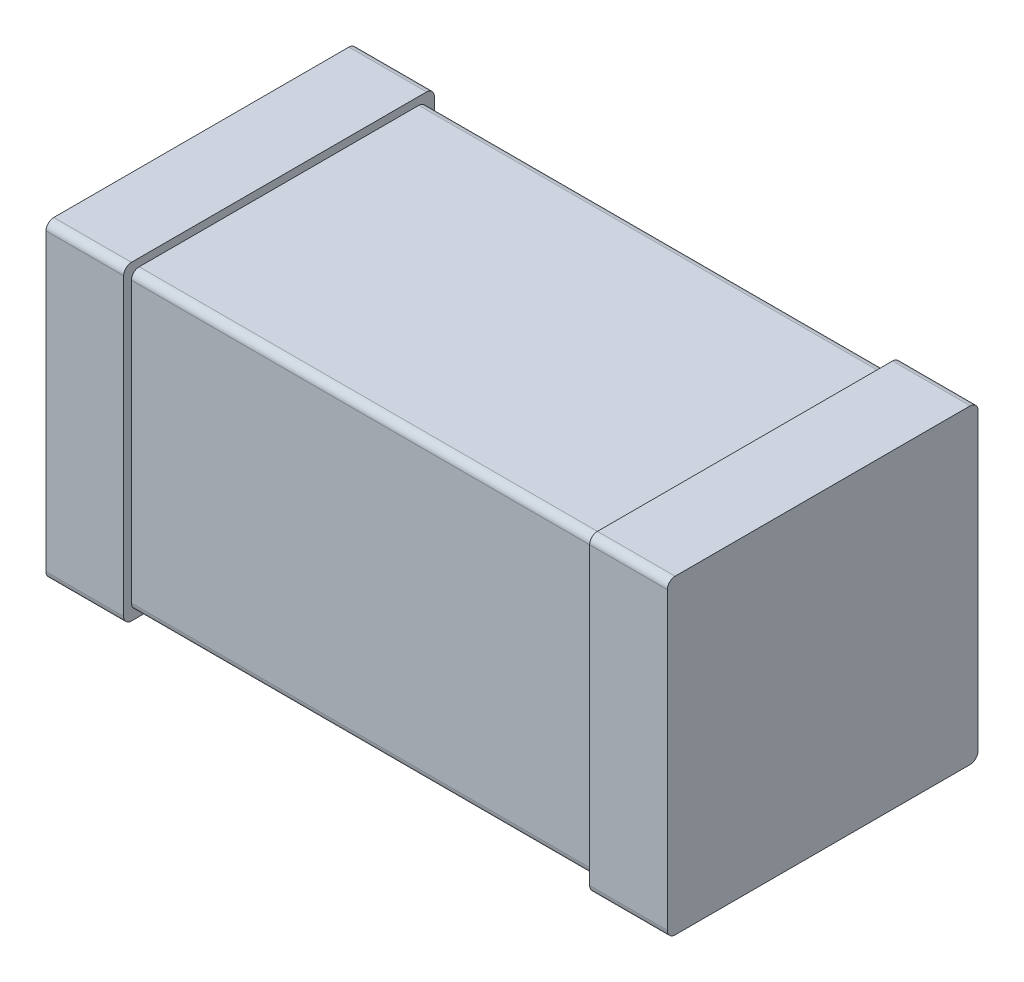
ISO-10303-21;
HEADER;
FILE_DESCRIPTION(('STEP AP214'),'2;1');
FILE_NAME('part.step','',(''),(''),'','','');
FILE_SCHEMA(('AUTOMOTIVE_DESIGN { 1 0 10303 214 1 1 1 1 }'));
ENDSEC;
DATA;
#1=APPLICATION_CONTEXT('core data for automotive mechanical design processes');
#2=APPLICATION_PROTOCOL_DEFINITION('international standard','automotive_design',2000,#1);
#3=PRODUCT_CONTEXT('',#1,'mechanical');
#4=PRODUCT('Part','Part','',(#3));
#5=PRODUCT_RELATED_PRODUCT_CATEGORY('part','',(#4));
#6=PRODUCT_DEFINITION_FORMATION('','',#4);
#7=PRODUCT_DEFINITION_CONTEXT('part definition',#1,'design');
#8=PRODUCT_DEFINITION('design','',#6,#7);
#9=PRODUCT_DEFINITION_SHAPE('','',#8);
#10=(LENGTH_UNIT() NAMED_UNIT(*) SI_UNIT(.MILLI.,.METRE.));
#11=(NAMED_UNIT(*) PLANE_ANGLE_UNIT() SI_UNIT($,.RADIAN.));
#12=(NAMED_UNIT(*) SI_UNIT($,.STERADIAN.) SOLID_ANGLE_UNIT());
#13=UNCERTAINTY_MEASURE_WITH_UNIT(LENGTH_MEASURE(1.E-05),#10,'distance_accuracy_value','');
#14=(GEOMETRIC_REPRESENTATION_CONTEXT(3) GLOBAL_UNCERTAINTY_ASSIGNED_CONTEXT((#13)) GLOBAL_UNIT_ASSIGNED_CONTEXT((#10,
#11,#12)) REPRESENTATION_CONTEXT('',''));
#15=CARTESIAN_POINT('',(0.,0.,0.));
#16=DIRECTION('',(0.,0.,1.));
#17=DIRECTION('',(1.,0.,0.));
#18=AXIS2_PLACEMENT_3D('',#15,#16,#17);
#19=CARTESIAN_POINT('',(-1.6,-0.8,0.));
#20=DIRECTION('',(1.,0.,0.));
#21=DIRECTION('',(0.,1.,0.));
#22=AXIS2_PLACEMENT_3D('',#19,#20,#21);
#23=PLANE('',#22);
#24=CARTESIAN_POINT('',(-1.6,-0.76,1.56));
#25=DIRECTION('',(-1.,0.,0.));
#26=DIRECTION('',(0.,0.,1.));
#27=AXIS2_PLACEMENT_3D('',#24,#25,#26);
#28=CIRCLE('',#27,0.04);
#29=CARTESIAN_POINT('',(-1.6,-0.8,1.56));
#30=VERTEX_POINT('',#29);
#31=CARTESIAN_POINT('',(-1.6,-0.76,1.6));
#32=VERTEX_POINT('',#31);
#33=EDGE_CURVE('E11',#30,#32,#28,.T.);
#34=ORIENTED_EDGE('',*,*,#33,.T.);
#35=DIRECTION('',(0.,1.,0.));
#36=VECTOR('',#35,1.);
#37=CARTESIAN_POINT('',(-1.6,-0.8,1.6));
#38=LINE('',#37,#36);
#39=CARTESIAN_POINT('',(-1.6,0.76,1.6));
#40=VERTEX_POINT('',#39);
#41=EDGE_CURVE('E27',#32,#40,#38,.T.);
#42=ORIENTED_EDGE('',*,*,#41,.T.);
#43=CARTESIAN_POINT('',(-1.6,0.76,1.56));
#44=DIRECTION('',(1.,0.,0.));
#45=DIRECTION('',(0.,0.,1.));
#46=AXIS2_PLACEMENT_3D('',#43,#44,#45);
#47=CIRCLE('',#46,0.04);
#48=CARTESIAN_POINT('',(-1.6,0.8,1.56));
#49=VERTEX_POINT('',#48);
#50=EDGE_CURVE('E241',#49,#40,#47,.T.);
#51=ORIENTED_EDGE('',*,*,#50,.F.);
#52=DIRECTION('',(0.,0.,1.));
#53=VECTOR('',#52,1.);
#54=CARTESIAN_POINT('',(-1.6,0.8,0.));
#55=LINE('',#54,#53);
#56=CARTESIAN_POINT('',(-1.6,0.8,0.04));
#57=VERTEX_POINT('',#56);
#58=EDGE_CURVE('E243',#57,#49,#55,.T.);
#59=ORIENTED_EDGE('',*,*,#58,.F.);
#60=CARTESIAN_POINT('',(-1.6,0.76,0.04));
#61=DIRECTION('',(-1.,0.,0.));
#62=DIRECTION('',(0.,0.,1.));
#63=AXIS2_PLACEMENT_3D('',#60,#61,#62);
#64=CIRCLE('',#63,0.04);
#65=CARTESIAN_POINT('',(-1.6,0.76,0.));
#66=VERTEX_POINT('',#65);
#67=EDGE_CURVE('E383',#57,#66,#64,.T.);
#68=ORIENTED_EDGE('',*,*,#67,.T.);
#69=DIRECTION('',(0.,1.,0.));
#70=VECTOR('',#69,1.);
#71=CARTESIAN_POINT('',(-1.6,-0.8,0.));
#72=LINE('',#71,#70);
#73=CARTESIAN_POINT('',(-1.6,-0.76,0.));
#74=VERTEX_POINT('',#73);
#75=EDGE_CURVE('E388',#74,#66,#72,.T.);
#76=ORIENTED_EDGE('',*,*,#75,.F.);
#77=CARTESIAN_POINT('',(-1.6,-0.76,0.04));
#78=DIRECTION('',(1.,0.,0.));
#79=DIRECTION('',(0.,0.,1.));
#80=AXIS2_PLACEMENT_3D('',#77,#78,#79);
#81=CIRCLE('',#80,0.04);
#82=CARTESIAN_POINT('',(-1.6,-0.8,0.04));
#83=VERTEX_POINT('',#82);
#84=EDGE_CURVE('E319',#83,#74,#81,.T.);
#85=ORIENTED_EDGE('',*,*,#84,.F.);
#86=DIRECTION('',(0.,0.,1.));
#87=VECTOR('',#86,1.);
#88=CARTESIAN_POINT('',(-1.6,-0.8,0.));
#89=LINE('',#88,#87);
#90=EDGE_CURVE('E381',#83,#30,#89,.T.);
#91=ORIENTED_EDGE('',*,*,#90,.T.);
#92=EDGE_LOOP('',(#34,#42,#51,#59,#68,#76,#85,#91));
#93=FACE_BOUND('',#92,.T.);
#94=ADVANCED_FACE('F16',(#93),#23,.F.);
#95=CARTESIAN_POINT('',(-1.6,-0.8,0.));
#96=DIRECTION('',(0.,1.,0.));
#97=DIRECTION('',(1.,0.,0.));
#98=AXIS2_PLACEMENT_3D('',#95,#96,#97);
#99=PLANE('',#98);
#100=DIRECTION('',(1.,0.,0.));
#101=VECTOR('',#100,1.);
#102=CARTESIAN_POINT('',(-1.6,-0.8,1.56));
#103=LINE('',#102,#101);
#104=CARTESIAN_POINT('',(-1.2,-0.8,1.56));
#105=VERTEX_POINT('',#104);
#106=EDGE_CURVE('E362',#30,#105,#103,.T.);
#107=ORIENTED_EDGE('',*,*,#106,.F.);
#108=ORIENTED_EDGE('',*,*,#90,.F.);
#109=DIRECTION('',(1.,0.,0.));
#110=VECTOR('',#109,1.);
#111=CARTESIAN_POINT('',(-1.6,-0.8,0.04));
#112=LINE('',#111,#110);
#113=CARTESIAN_POINT('',(-1.2,-0.8,0.04));
#114=VERTEX_POINT('',#113);
#115=EDGE_CURVE('E276',#83,#114,#112,.T.);
#116=ORIENTED_EDGE('',*,*,#115,.T.);
#117=DIRECTION('',(0.,0.,1.));
#118=VECTOR('',#117,1.);
#119=CARTESIAN_POINT('',(-1.2,-0.8,0.));
#120=LINE('',#119,#118);
#121=EDGE_CURVE('E323',#114,#105,#120,.T.);
#122=ORIENTED_EDGE('',*,*,#121,.T.);
#123=EDGE_LOOP('',(#107,#108,#116,#122));
#124=FACE_BOUND('',#123,.T.);
#125=ADVANCED_FACE('F736',(#124),#99,.F.);
#126=CARTESIAN_POINT('',(-1.6,-0.76,0.04));
#127=DIRECTION('',(1.,0.,0.));
#128=DIRECTION('',(0.,-1.,0.));
#129=AXIS2_PLACEMENT_3D('',#126,#127,#128);
#130=CYLINDRICAL_SURFACE('',#129,0.04);
#131=ORIENTED_EDGE('',*,*,#84,.T.);
#132=DIRECTION('',(1.,0.,0.));
#133=VECTOR('',#132,1.);
#134=CARTESIAN_POINT('',(-1.6,-0.76,0.));
#135=LINE('',#134,#133);
#136=CARTESIAN_POINT('',(-1.2,-0.76,0.));
#137=VERTEX_POINT('',#136);
#138=EDGE_CURVE('E324',#74,#137,#135,.T.);
#139=ORIENTED_EDGE('',*,*,#138,.T.);
#140=CARTESIAN_POINT('',(-1.2,-0.76,0.04));
#141=DIRECTION('',(1.,0.,0.));
#142=DIRECTION('',(0.,0.,1.));
#143=AXIS2_PLACEMENT_3D('',#140,#141,#142);
#144=CIRCLE('',#143,0.04);
#145=EDGE_CURVE('E393',#114,#137,#144,.T.);
#146=ORIENTED_EDGE('',*,*,#145,.F.);
#147=ORIENTED_EDGE('',*,*,#115,.F.);
#148=EDGE_LOOP('',(#131,#139,#146,#147));
#149=FACE_BOUND('',#148,.T.);
#150=ADVANCED_FACE('F728',(#149),#130,.T.);
#151=CARTESIAN_POINT('',(-1.6,-0.76,1.56));
#152=DIRECTION('',(1.,0.,0.));
#153=DIRECTION('',(0.,-1.,0.));
#154=AXIS2_PLACEMENT_3D('',#151,#152,#153);
#155=CYLINDRICAL_SURFACE('',#154,0.04);
#156=ORIENTED_EDGE('',*,*,#106,.T.);
#157=CARTESIAN_POINT('',(-1.2,-0.76,1.56));
#158=DIRECTION('',(-1.,0.,0.));
#159=DIRECTION('',(0.,0.,1.));
#160=AXIS2_PLACEMENT_3D('',#157,#158,#159);
#161=CIRCLE('',#160,0.04);
#162=CARTESIAN_POINT('',(-1.2,-0.76,1.6));
#163=VERTEX_POINT('',#162);
#164=EDGE_CURVE('E359',#105,#163,#161,.T.);
#165=ORIENTED_EDGE('',*,*,#164,.T.);
#166=DIRECTION('',(1.,0.,0.));
#167=VECTOR('',#166,1.);
#168=CARTESIAN_POINT('',(-1.6,-0.76,1.6));
#169=LINE('',#168,#167);
#170=EDGE_CURVE('E249',#32,#163,#169,.T.);
#171=ORIENTED_EDGE('',*,*,#170,.F.);
#172=ORIENTED_EDGE('',*,*,#33,.F.);
#173=EDGE_LOOP('',(#156,#165,#171,#172));
#174=FACE_BOUND('',#173,.T.);
#175=ADVANCED_FACE('F719',(#174),#155,.T.);
#176=CARTESIAN_POINT('',(-1.6,-0.8,0.));
#177=DIRECTION('',(0.,0.,1.));
#178=DIRECTION('',(1.,0.,0.));
#179=AXIS2_PLACEMENT_3D('',#176,#177,#178);
#180=PLANE('',#179);
#181=DIRECTION('',(1.,0.,0.));
#182=VECTOR('',#181,1.);
#183=CARTESIAN_POINT('',(-1.6,0.76,0.));
#184=LINE('',#183,#182);
#185=CARTESIAN_POINT('',(-1.2,0.76,0.));
#186=VERTEX_POINT('',#185);
#187=EDGE_CURVE('E363',#66,#186,#184,.T.);
#188=ORIENTED_EDGE('',*,*,#187,.T.);
#189=DIRECTION('',(0.,1.,0.));
#190=VECTOR('',#189,1.);
#191=CARTESIAN_POINT('',(-1.2,-0.8,0.));
#192=LINE('',#191,#190);
#193=EDGE_CURVE('E268',#137,#186,#192,.T.);
#194=ORIENTED_EDGE('',*,*,#193,.F.);
#195=ORIENTED_EDGE('',*,*,#138,.F.);
#196=ORIENTED_EDGE('',*,*,#75,.T.);
#197=EDGE_LOOP('',(#188,#194,#195,#196));
#198=FACE_BOUND('',#197,.T.);
#199=ADVANCED_FACE('F711',(#198),#180,.F.);
#200=CARTESIAN_POINT('',(-1.6,-0.8,1.6));
#201=DIRECTION('',(0.,0.,1.));
#202=DIRECTION('',(1.,0.,0.));
#203=AXIS2_PLACEMENT_3D('',#200,#201,#202);
#204=PLANE('',#203);
#205=ORIENTED_EDGE('',*,*,#41,.F.);
#206=ORIENTED_EDGE('',*,*,#170,.T.);
#207=DIRECTION('',(0.,1.,0.));
#208=VECTOR('',#207,1.);
#209=CARTESIAN_POINT('',(-1.2,-0.8,1.6));
#210=LINE('',#209,#208);
#211=CARTESIAN_POINT('',(-1.2,0.76,1.6));
#212=VERTEX_POINT('',#211);
#213=EDGE_CURVE('E246',#163,#212,#210,.T.);
#214=ORIENTED_EDGE('',*,*,#213,.T.);
#215=DIRECTION('',(1.,0.,0.));
#216=VECTOR('',#215,1.);
#217=CARTESIAN_POINT('',(-1.6,0.76,1.6));
#218=LINE('',#217,#216);
#219=EDGE_CURVE('E233',#40,#212,#218,.T.);
#220=ORIENTED_EDGE('',*,*,#219,.F.);
#221=EDGE_LOOP('',(#205,#206,#214,#220));
#222=FACE_BOUND('',#221,.T.);
#223=ADVANCED_FACE('F247',(#222),#204,.T.);
#224=CARTESIAN_POINT('',(-1.6,0.76,0.04));
#225=DIRECTION('',(1.,0.,0.));
#226=DIRECTION('',(0.,1.,0.));
#227=AXIS2_PLACEMENT_3D('',#224,#225,#226);
#228=CYLINDRICAL_SURFACE('',#227,0.04);
#229=DIRECTION('',(1.,0.,0.));
#230=VECTOR('',#229,1.);
#231=CARTESIAN_POINT('',(-1.6,0.8,0.04));
#232=LINE('',#231,#230);
#233=CARTESIAN_POINT('',(-1.2,0.8,0.04));
#234=VERTEX_POINT('',#233);
#235=EDGE_CURVE('E254',#57,#234,#232,.T.);
#236=ORIENTED_EDGE('',*,*,#235,.T.);
#237=CARTESIAN_POINT('',(-1.2,0.76,0.04));
#238=DIRECTION('',(-1.,0.,0.));
#239=DIRECTION('',(0.,0.,1.));
#240=AXIS2_PLACEMENT_3D('',#237,#238,#239);
#241=CIRCLE('',#240,0.04);
#242=EDGE_CURVE('E349',#234,#186,#241,.T.);
#243=ORIENTED_EDGE('',*,*,#242,.T.);
#244=ORIENTED_EDGE('',*,*,#187,.F.);
#245=ORIENTED_EDGE('',*,*,#67,.F.);
#246=EDGE_LOOP('',(#236,#243,#244,#245));
#247=FACE_BOUND('',#246,.T.);
#248=ADVANCED_FACE('F696',(#247),#228,.T.);
#249=CARTESIAN_POINT('',(-1.6,0.76,1.56));
#250=DIRECTION('',(1.,0.,0.));
#251=DIRECTION('',(0.,1.,0.));
#252=AXIS2_PLACEMENT_3D('',#249,#250,#251);
#253=CYLINDRICAL_SURFACE('',#252,0.04);
#254=ORIENTED_EDGE('',*,*,#50,.T.);
#255=ORIENTED_EDGE('',*,*,#219,.T.);
#256=CARTESIAN_POINT('',(-1.2,0.76,1.56));
#257=DIRECTION('',(1.,0.,0.));
#258=DIRECTION('',(0.,0.,1.));
#259=AXIS2_PLACEMENT_3D('',#256,#257,#258);
#260=CIRCLE('',#259,0.04);
#261=CARTESIAN_POINT('',(-1.2,0.8,1.56));
#262=VERTEX_POINT('',#261);
#263=EDGE_CURVE('E238',#262,#212,#260,.T.);
#264=ORIENTED_EDGE('',*,*,#263,.F.);
#265=DIRECTION('',(1.,0.,0.));
#266=VECTOR('',#265,1.);
#267=CARTESIAN_POINT('',(-1.6,0.8,1.56));
#268=LINE('',#267,#266);
#269=EDGE_CURVE('E346',#49,#262,#268,.T.);
#270=ORIENTED_EDGE('',*,*,#269,.F.);
#271=EDGE_LOOP('',(#254,#255,#264,#270));
#272=FACE_BOUND('',#271,.T.);
#273=ADVANCED_FACE('F235',(#272),#253,.T.);
#274=CARTESIAN_POINT('',(-1.6,0.8,0.));
#275=DIRECTION('',(0.,1.,0.));
#276=DIRECTION('',(1.,0.,0.));
#277=AXIS2_PLACEMENT_3D('',#274,#275,#276);
#278=PLANE('',#277);
#279=DIRECTION('',(0.,0.,1.));
#280=VECTOR('',#279,1.);
#281=CARTESIAN_POINT('',(-1.2,0.8,0.));
#282=LINE('',#281,#280);
#283=EDGE_CURVE('E260',#234,#262,#282,.T.);
#284=ORIENTED_EDGE('',*,*,#283,.F.);
#285=ORIENTED_EDGE('',*,*,#235,.F.);
#286=ORIENTED_EDGE('',*,*,#58,.T.);
#287=ORIENTED_EDGE('',*,*,#269,.T.);
#288=EDGE_LOOP('',(#284,#285,#286,#287));
#289=FACE_BOUND('',#288,.T.);
#290=ADVANCED_FACE('F676',(#289),#278,.T.);
#291=CARTESIAN_POINT('',(-1.2,-0.8,0.));
#292=DIRECTION('',(1.,0.,0.));
#293=DIRECTION('',(0.,1.,0.));
#294=AXIS2_PLACEMENT_3D('',#291,#292,#293);
#295=PLANE('',#294);
#296=ORIENTED_EDGE('',*,*,#121,.F.);
#297=ORIENTED_EDGE('',*,*,#145,.T.);
#298=ORIENTED_EDGE('',*,*,#193,.T.);
#299=ORIENTED_EDGE('',*,*,#242,.F.);
#300=ORIENTED_EDGE('',*,*,#283,.T.);
#301=ORIENTED_EDGE('',*,*,#263,.T.);
#302=ORIENTED_EDGE('',*,*,#213,.F.);
#303=ORIENTED_EDGE('',*,*,#164,.F.);
#304=EDGE_LOOP('',(#296,#297,#298,#299,#300,#301,#302,#303));
#305=FACE_BOUND('',#304,.T.);
#306=CARTESIAN_POINT('',(-1.2,-0.72,0.08));
#307=DIRECTION('',(1.,0.,0.));
#308=DIRECTION('',(0.,0.,1.));
#309=AXIS2_PLACEMENT_3D('',#306,#307,#308);
#310=CIRCLE('',#309,0.04);
#311=CARTESIAN_POINT('',(-1.2,-0.76,0.08));
#312=VERTEX_POINT('',#311);
#313=CARTESIAN_POINT('',(-1.2,-0.72,0.04));
#314=VERTEX_POINT('',#313);
#315=EDGE_CURVE('E376',#312,#314,#310,.T.);
#316=ORIENTED_EDGE('',*,*,#315,.F.);
#317=DIRECTION('',(0.,0.,1.));
#318=VECTOR('',#317,1.);
#319=CARTESIAN_POINT('',(-1.2,-0.76,0.04));
#320=LINE('',#319,#318);
#321=CARTESIAN_POINT('',(-1.2,-0.76,1.52));
#322=VERTEX_POINT('',#321);
#323=EDGE_CURVE('E262',#312,#322,#320,.T.);
#324=ORIENTED_EDGE('',*,*,#323,.T.);
#325=CARTESIAN_POINT('',(-1.2,-0.72,1.52));
#326=DIRECTION('',(-1.,0.,0.));
#327=DIRECTION('',(0.,0.,1.));
#328=AXIS2_PLACEMENT_3D('',#325,#326,#327);
#329=CIRCLE('',#328,0.04);
#330=CARTESIAN_POINT('',(-1.2,-0.72,1.56));
#331=VERTEX_POINT('',#330);
#332=EDGE_CURVE('E272',#322,#331,#329,.T.);
#333=ORIENTED_EDGE('',*,*,#332,.T.);
#334=DIRECTION('',(0.,1.,0.));
#335=VECTOR('',#334,1.);
#336=CARTESIAN_POINT('',(-1.2,-0.76,1.56));
#337=LINE('',#336,#335);
#338=CARTESIAN_POINT('',(-1.2,0.72,1.56));
#339=VERTEX_POINT('',#338);
#340=EDGE_CURVE('E399',#331,#339,#337,.T.);
#341=ORIENTED_EDGE('',*,*,#340,.T.);
#342=CARTESIAN_POINT('',(-1.2,0.72,1.52));
#343=DIRECTION('',(1.,0.,0.));
#344=DIRECTION('',(0.,0.,1.));
#345=AXIS2_PLACEMENT_3D('',#342,#343,#344);
#346=CIRCLE('',#345,0.04);
#347=CARTESIAN_POINT('',(-1.2,0.76,1.52));
#348=VERTEX_POINT('',#347);
#349=EDGE_CURVE('E295',#348,#339,#346,.T.);
#350=ORIENTED_EDGE('',*,*,#349,.F.);
#351=DIRECTION('',(0.,0.,1.));
#352=VECTOR('',#351,1.);
#353=CARTESIAN_POINT('',(-1.2,0.76,0.04));
#354=LINE('',#353,#352);
#355=CARTESIAN_POINT('',(-1.2,0.76,0.08));
#356=VERTEX_POINT('',#355);
#357=EDGE_CURVE('E307',#356,#348,#354,.T.);
#358=ORIENTED_EDGE('',*,*,#357,.F.);
#359=CARTESIAN_POINT('',(-1.2,0.72,0.08));
#360=DIRECTION('',(-1.,0.,0.));
#361=DIRECTION('',(0.,0.,1.));
#362=AXIS2_PLACEMENT_3D('',#359,#360,#361);
#363=CIRCLE('',#362,0.04);
#364=CARTESIAN_POINT('',(-1.2,0.72,0.04));
#365=VERTEX_POINT('',#364);
#366=EDGE_CURVE('E380',#356,#365,#363,.T.);
#367=ORIENTED_EDGE('',*,*,#366,.T.);
#368=DIRECTION('',(0.,1.,0.));
#369=VECTOR('',#368,1.);
#370=CARTESIAN_POINT('',(-1.2,-0.76,0.04));
#371=LINE('',#370,#369);
#372=EDGE_CURVE('E355',#314,#365,#371,.T.);
#373=ORIENTED_EDGE('',*,*,#372,.F.);
#374=EDGE_LOOP('',(#316,#324,#333,#341,#350,#358,#367,#373));
#375=FACE_BOUND('',#374,.T.);
#376=ADVANCED_FACE('F257',(#305,#375),#295,.T.);
#377=CARTESIAN_POINT('',(-1.2,-0.72,0.08));
#378=DIRECTION('',(1.,0.,0.));
#379=DIRECTION('',(0.,-1.,0.));
#380=AXIS2_PLACEMENT_3D('',#377,#378,#379);
#381=CYLINDRICAL_SURFACE('',#380,0.04);
#382=ORIENTED_EDGE('',*,*,#315,.T.);
#383=DIRECTION('',(1.,0.,0.));
#384=VECTOR('',#383,1.);
#385=CARTESIAN_POINT('',(-1.2,-0.72,0.04));
#386=LINE('',#385,#384);
#387=CARTESIAN_POINT('',(1.2,-0.72,0.04));
#388=VERTEX_POINT('',#387);
#389=EDGE_CURVE('E354',#314,#388,#386,.T.);
#390=ORIENTED_EDGE('',*,*,#389,.T.);
#391=CARTESIAN_POINT('',(1.2,-0.72,0.08));
#392=DIRECTION('',(1.,0.,0.));
#393=DIRECTION('',(0.,0.,1.));
#394=AXIS2_PLACEMENT_3D('',#391,#392,#393);
#395=CIRCLE('',#394,0.04);
#396=CARTESIAN_POINT('',(1.2,-0.76,0.08));
#397=VERTEX_POINT('',#396);
#398=EDGE_CURVE('E410',#397,#388,#395,.T.);
#399=ORIENTED_EDGE('',*,*,#398,.F.);
#400=DIRECTION('',(1.,0.,0.));
#401=VECTOR('',#400,1.);
#402=CARTESIAN_POINT('',(-1.2,-0.76,0.08));
#403=LINE('',#402,#401);
#404=EDGE_CURVE('E325',#312,#397,#403,.T.);
#405=ORIENTED_EDGE('',*,*,#404,.F.);
#406=EDGE_LOOP('',(#382,#390,#399,#405));
#407=FACE_BOUND('',#406,.T.);
#408=ADVANCED_FACE('F514',(#407),#381,.T.);
#409=CARTESIAN_POINT('',(-1.2,-0.76,0.04));
#410=DIRECTION('',(0.,0.,1.));
#411=DIRECTION('',(1.,0.,0.));
#412=AXIS2_PLACEMENT_3D('',#409,#410,#411);
#413=PLANE('',#412);
#414=DIRECTION('',(1.,0.,0.));
#415=VECTOR('',#414,1.);
#416=CARTESIAN_POINT('',(-1.2,0.72,0.04));
#417=LINE('',#416,#415);
#418=CARTESIAN_POINT('',(1.2,0.72,0.04));
#419=VERTEX_POINT('',#418);
#420=EDGE_CURVE('E350',#365,#419,#417,.T.);
#421=ORIENTED_EDGE('',*,*,#420,.T.);
#422=DIRECTION('',(0.,1.,0.));
#423=VECTOR('',#422,1.);
#424=CARTESIAN_POINT('',(1.2,-0.76,0.04));
#425=LINE('',#424,#423);
#426=EDGE_CURVE('E436',#388,#419,#425,.T.);
#427=ORIENTED_EDGE('',*,*,#426,.F.);
#428=ORIENTED_EDGE('',*,*,#389,.F.);
#429=ORIENTED_EDGE('',*,*,#372,.T.);
#430=EDGE_LOOP('',(#421,#427,#428,#429));
#431=FACE_BOUND('',#430,.T.);
#432=ADVANCED_FACE('F520',(#431),#413,.F.);
#433=CARTESIAN_POINT('',(-1.2,0.72,0.08));
#434=DIRECTION('',(1.,0.,0.));
#435=DIRECTION('',(0.,1.,0.));
#436=AXIS2_PLACEMENT_3D('',#433,#434,#435);
#437=CYLINDRICAL_SURFACE('',#436,0.04);
#438=DIRECTION('',(1.,0.,0.));
#439=VECTOR('',#438,1.);
#440=CARTESIAN_POINT('',(-1.2,0.76,0.08));
#441=LINE('',#440,#439);
#442=CARTESIAN_POINT('',(1.2,0.76,0.08));
#443=VERTEX_POINT('',#442);
#444=EDGE_CURVE('E364',#356,#443,#441,.T.);
#445=ORIENTED_EDGE('',*,*,#444,.T.);
#446=CARTESIAN_POINT('',(1.2,0.72,0.08));
#447=DIRECTION('',(-1.,0.,0.));
#448=DIRECTION('',(0.,0.,1.));
#449=AXIS2_PLACEMENT_3D('',#446,#447,#448);
#450=CIRCLE('',#449,0.04);
#451=EDGE_CURVE('E311',#443,#419,#450,.T.);
#452=ORIENTED_EDGE('',*,*,#451,.T.);
#453=ORIENTED_EDGE('',*,*,#420,.F.);
#454=ORIENTED_EDGE('',*,*,#366,.F.);
#455=EDGE_LOOP('',(#445,#452,#453,#454));
#456=FACE_BOUND('',#455,.T.);
#457=ADVANCED_FACE('F523',(#456),#437,.T.);
#458=CARTESIAN_POINT('',(-1.2,0.76,0.04));
#459=DIRECTION('',(0.,1.,0.));
#460=DIRECTION('',(1.,0.,0.));
#461=AXIS2_PLACEMENT_3D('',#458,#459,#460);
#462=PLANE('',#461);
#463=DIRECTION('',(0.,0.,1.));
#464=VECTOR('',#463,1.);
#465=CARTESIAN_POINT('',(1.2,0.76,0.04));
#466=LINE('',#465,#464);
#467=CARTESIAN_POINT('',(1.2,0.76,1.52));
#468=VERTEX_POINT('',#467);
#469=EDGE_CURVE('E425',#443,#468,#466,.T.);
#470=ORIENTED_EDGE('',*,*,#469,.F.);
#471=ORIENTED_EDGE('',*,*,#444,.F.);
#472=ORIENTED_EDGE('',*,*,#357,.T.);
#473=DIRECTION('',(1.,0.,0.));
#474=VECTOR('',#473,1.);
#475=CARTESIAN_POINT('',(-1.2,0.76,1.52));
#476=LINE('',#475,#474);
#477=EDGE_CURVE('E312',#348,#468,#476,.T.);
#478=ORIENTED_EDGE('',*,*,#477,.T.);
#479=EDGE_LOOP('',(#470,#471,#472,#478));
#480=FACE_BOUND('',#479,.T.);
#481=ADVANCED_FACE('F499',(#480),#462,.T.);
#482=CARTESIAN_POINT('',(-1.2,0.72,1.52));
#483=DIRECTION('',(1.,0.,0.));
#484=DIRECTION('',(0.,1.,0.));
#485=AXIS2_PLACEMENT_3D('',#482,#483,#484);
#486=CYLINDRICAL_SURFACE('',#485,0.04);
#487=ORIENTED_EDGE('',*,*,#349,.T.);
#488=DIRECTION('',(1.,0.,0.));
#489=VECTOR('',#488,1.);
#490=CARTESIAN_POINT('',(-1.2,0.72,1.56));
#491=LINE('',#490,#489);
#492=CARTESIAN_POINT('',(1.2,0.72,1.56));
#493=VERTEX_POINT('',#492);
#494=EDGE_CURVE('E291',#339,#493,#491,.T.);
#495=ORIENTED_EDGE('',*,*,#494,.T.);
#496=CARTESIAN_POINT('',(1.2,0.72,1.52));
#497=DIRECTION('',(1.,0.,0.));
#498=DIRECTION('',(0.,0.,1.));
#499=AXIS2_PLACEMENT_3D('',#496,#497,#498);
#500=CIRCLE('',#499,0.04);
#501=EDGE_CURVE('E422',#468,#493,#500,.T.);
#502=ORIENTED_EDGE('',*,*,#501,.F.);
#503=ORIENTED_EDGE('',*,*,#477,.F.);
#504=EDGE_LOOP('',(#487,#495,#502,#503));
#505=FACE_BOUND('',#504,.T.);
#506=ADVANCED_FACE('F501',(#505),#486,.T.);
#507=CARTESIAN_POINT('',(-1.2,-0.76,1.56));
#508=DIRECTION('',(0.,0.,1.));
#509=DIRECTION('',(1.,0.,0.));
#510=AXIS2_PLACEMENT_3D('',#507,#508,#509);
#511=PLANE('',#510);
#512=ORIENTED_EDGE('',*,*,#340,.F.);
#513=DIRECTION('',(1.,0.,0.));
#514=VECTOR('',#513,1.);
#515=CARTESIAN_POINT('',(-1.2,-0.72,1.56));
#516=LINE('',#515,#514);
#517=CARTESIAN_POINT('',(1.2,-0.72,1.56));
#518=VERTEX_POINT('',#517);
#519=EDGE_CURVE('E296',#331,#518,#516,.T.);
#520=ORIENTED_EDGE('',*,*,#519,.T.);
#521=DIRECTION('',(0.,1.,0.));
#522=VECTOR('',#521,1.);
#523=CARTESIAN_POINT('',(1.2,-0.76,1.56));
#524=LINE('',#523,#522);
#525=EDGE_CURVE('E403',#518,#493,#524,.T.);
#526=ORIENTED_EDGE('',*,*,#525,.T.);
#527=ORIENTED_EDGE('',*,*,#494,.F.);
#528=EDGE_LOOP('',(#512,#520,#526,#527));
#529=FACE_BOUND('',#528,.T.);
#530=ADVANCED_FACE('F18',(#529),#511,.T.);
#531=CARTESIAN_POINT('',(-1.2,-0.72,1.52));
#532=DIRECTION('',(1.,0.,0.));
#533=DIRECTION('',(0.,-1.,0.));
#534=AXIS2_PLACEMENT_3D('',#531,#532,#533);
#535=CYLINDRICAL_SURFACE('',#534,0.04);
#536=DIRECTION('',(1.,0.,0.));
#537=VECTOR('',#536,1.);
#538=CARTESIAN_POINT('',(-1.2,-0.76,1.52));
#539=LINE('',#538,#537);
#540=CARTESIAN_POINT('',(1.2,-0.76,1.52));
#541=VERTEX_POINT('',#540);
#542=EDGE_CURVE('E334',#322,#541,#539,.T.);
#543=ORIENTED_EDGE('',*,*,#542,.T.);
#544=CARTESIAN_POINT('',(1.2,-0.72,1.52));
#545=DIRECTION('',(-1.,0.,0.));
#546=DIRECTION('',(0.,0.,1.));
#547=AXIS2_PLACEMENT_3D('',#544,#545,#546);
#548=CIRCLE('',#547,0.04);
#549=EDGE_CURVE('E329',#541,#518,#548,.T.);
#550=ORIENTED_EDGE('',*,*,#549,.T.);
#551=ORIENTED_EDGE('',*,*,#519,.F.);
#552=ORIENTED_EDGE('',*,*,#332,.F.);
#553=EDGE_LOOP('',(#543,#550,#551,#552));
#554=FACE_BOUND('',#553,.T.);
#555=ADVANCED_FACE('F508',(#554),#535,.T.);
#556=CARTESIAN_POINT('',(-1.2,-0.76,0.04));
#557=DIRECTION('',(0.,1.,0.));
#558=DIRECTION('',(1.,0.,0.));
#559=AXIS2_PLACEMENT_3D('',#556,#557,#558);
#560=PLANE('',#559);
#561=ORIENTED_EDGE('',*,*,#542,.F.);
#562=ORIENTED_EDGE('',*,*,#323,.F.);
#563=ORIENTED_EDGE('',*,*,#404,.T.);
#564=DIRECTION('',(0.,0.,1.));
#565=VECTOR('',#564,1.);
#566=CARTESIAN_POINT('',(1.2,-0.76,0.04));
#567=LINE('',#566,#565);
#568=EDGE_CURVE('E330',#397,#541,#567,.T.);
#569=ORIENTED_EDGE('',*,*,#568,.T.);
#570=EDGE_LOOP('',(#561,#562,#563,#569));
#571=FACE_BOUND('',#570,.T.);
#572=ADVANCED_FACE('F511',(#571),#560,.F.);
#573=CARTESIAN_POINT('',(1.2,-0.8,0.));
#574=DIRECTION('',(1.,0.,0.));
#575=DIRECTION('',(0.,1.,0.));
#576=AXIS2_PLACEMENT_3D('',#573,#574,#575);
#577=PLANE('',#576);
#578=CARTESIAN_POINT('',(1.2,-0.76,1.56));
#579=DIRECTION('',(-1.,0.,0.));
#580=DIRECTION('',(0.,0.,1.));
#581=AXIS2_PLACEMENT_3D('',#578,#579,#580);
#582=CIRCLE('',#581,0.04);
#583=CARTESIAN_POINT('',(1.2,-0.8,1.56));
#584=VERTEX_POINT('',#583);
#585=CARTESIAN_POINT('',(1.2,-0.76,1.6));
#586=VERTEX_POINT('',#585);
#587=EDGE_CURVE('E339',#584,#586,#582,.T.);
#588=ORIENTED_EDGE('',*,*,#587,.T.);
#589=DIRECTION('',(0.,1.,0.));
#590=VECTOR('',#589,1.);
#591=CARTESIAN_POINT('',(1.2,-0.8,1.6));
#592=LINE('',#591,#590);
#593=CARTESIAN_POINT('',(1.2,0.76,1.6));
#594=VERTEX_POINT('',#593);
#595=EDGE_CURVE('E335',#586,#594,#592,.T.);
#596=ORIENTED_EDGE('',*,*,#595,.T.);
#597=CARTESIAN_POINT('',(1.2,0.76,1.56));
#598=DIRECTION('',(1.,0.,0.));
#599=DIRECTION('',(0.,0.,1.));
#600=AXIS2_PLACEMENT_3D('',#597,#598,#599);
#601=CIRCLE('',#600,0.04);
#602=CARTESIAN_POINT('',(1.2,0.8,1.56));
#603=VERTEX_POINT('',#602);
#604=EDGE_CURVE('E358',#603,#594,#601,.T.);
#605=ORIENTED_EDGE('',*,*,#604,.F.);
#606=DIRECTION('',(0.,0.,1.));
#607=VECTOR('',#606,1.);
#608=CARTESIAN_POINT('',(1.2,0.8,0.));
#609=LINE('',#608,#607);
#610=CARTESIAN_POINT('',(1.2,0.8,0.04));
#611=VERTEX_POINT('',#610);
#612=EDGE_CURVE('E370',#611,#603,#609,.T.);
#613=ORIENTED_EDGE('',*,*,#612,.F.);
#614=CARTESIAN_POINT('',(1.2,0.76,0.04));
#615=DIRECTION('',(-1.,0.,0.));
#616=DIRECTION('',(0.,0.,1.));
#617=AXIS2_PLACEMENT_3D('',#614,#615,#616);
#618=CIRCLE('',#617,0.04);
#619=CARTESIAN_POINT('',(1.2,0.76,0.));
#620=VERTEX_POINT('',#619);
#621=EDGE_CURVE('E340',#611,#620,#618,.T.);
#622=ORIENTED_EDGE('',*,*,#621,.T.);
#623=DIRECTION('',(0.,1.,0.));
#624=VECTOR('',#623,1.);
#625=CARTESIAN_POINT('',(1.2,-0.8,0.));
#626=LINE('',#625,#624);
#627=CARTESIAN_POINT('',(1.2,-0.76,0.));
#628=VERTEX_POINT('',#627);
#629=EDGE_CURVE('E278',#628,#620,#626,.T.);
#630=ORIENTED_EDGE('',*,*,#629,.F.);
#631=CARTESIAN_POINT('',(1.2,-0.76,0.04));
#632=DIRECTION('',(1.,0.,0.));
#633=DIRECTION('',(0.,0.,1.));
#634=AXIS2_PLACEMENT_3D('',#631,#632,#633);
#635=CIRCLE('',#634,0.04);
#636=CARTESIAN_POINT('',(1.2,-0.8,0.04));
#637=VERTEX_POINT('',#636);
#638=EDGE_CURVE('E302',#637,#628,#635,.T.);
#639=ORIENTED_EDGE('',*,*,#638,.F.);
#640=DIRECTION('',(0.,0.,1.));
#641=VECTOR('',#640,1.);
#642=CARTESIAN_POINT('',(1.2,-0.8,0.));
#643=LINE('',#642,#641);
#644=EDGE_CURVE('E432',#637,#584,#643,.T.);
#645=ORIENTED_EDGE('',*,*,#644,.T.);
#646=EDGE_LOOP('',(#588,#596,#605,#613,#622,#630,#639,#645));
#647=FACE_BOUND('',#646,.T.);
#648=ORIENTED_EDGE('',*,*,#426,.T.);
#649=ORIENTED_EDGE('',*,*,#451,.F.);
#650=ORIENTED_EDGE('',*,*,#469,.T.);
#651=ORIENTED_EDGE('',*,*,#501,.T.);
#652=ORIENTED_EDGE('',*,*,#525,.F.);
#653=ORIENTED_EDGE('',*,*,#549,.F.);
#654=ORIENTED_EDGE('',*,*,#568,.F.);
#655=ORIENTED_EDGE('',*,*,#398,.T.);
#656=EDGE_LOOP('',(#648,#649,#650,#651,#652,#653,#654,#655));
#657=FACE_BOUND('',#656,.T.);
#658=ADVANCED_FACE('F493',(#647,#657),#577,.F.);
#659=CARTESIAN_POINT('',(1.2,-0.8,0.));
#660=DIRECTION('',(0.,1.,0.));
#661=DIRECTION('',(1.,0.,0.));
#662=AXIS2_PLACEMENT_3D('',#659,#660,#661);
#663=PLANE('',#662);
#664=DIRECTION('',(1.,0.,0.));
#665=VECTOR('',#664,1.);
#666=CARTESIAN_POINT('',(1.2,-0.8,1.56));
#667=LINE('',#666,#665);
#668=CARTESIAN_POINT('',(1.6,-0.8,1.56));
#669=VERTEX_POINT('',#668);
#670=EDGE_CURVE('E287',#584,#669,#667,.T.);
#671=ORIENTED_EDGE('',*,*,#670,.F.);
#672=ORIENTED_EDGE('',*,*,#644,.F.);
#673=DIRECTION('',(1.,0.,0.));
#674=VECTOR('',#673,1.);
#675=CARTESIAN_POINT('',(1.2,-0.8,0.04));
#676=LINE('',#675,#674);
#677=CARTESIAN_POINT('',(1.6,-0.8,0.04));
#678=VERTEX_POINT('',#677);
#679=EDGE_CURVE('E301',#637,#678,#676,.T.);
#680=ORIENTED_EDGE('',*,*,#679,.T.);
#681=DIRECTION('',(0.,0.,1.));
#682=VECTOR('',#681,1.);
#683=CARTESIAN_POINT('',(1.6,-0.8,0.));
#684=LINE('',#683,#682);
#685=EDGE_CURVE('E297',#678,#669,#684,.T.);
#686=ORIENTED_EDGE('',*,*,#685,.T.);
#687=EDGE_LOOP('',(#671,#672,#680,#686));
#688=FACE_BOUND('',#687,.T.);
#689=ADVANCED_FACE('F570',(#688),#663,.F.);
#690=CARTESIAN_POINT('',(1.2,-0.76,0.04));
#691=DIRECTION('',(1.,0.,0.));
#692=DIRECTION('',(0.,-1.,0.));
#693=AXIS2_PLACEMENT_3D('',#690,#691,#692);
#694=CYLINDRICAL_SURFACE('',#693,0.04);
#695=ORIENTED_EDGE('',*,*,#638,.T.);
#696=DIRECTION('',(1.,0.,0.));
#697=VECTOR('',#696,1.);
#698=CARTESIAN_POINT('',(1.2,-0.76,0.));
#699=LINE('',#698,#697);
#700=CARTESIAN_POINT('',(1.6,-0.76,0.));
#701=VERTEX_POINT('',#700);
#702=EDGE_CURVE('E20',#628,#701,#699,.T.);
#703=ORIENTED_EDGE('',*,*,#702,.T.);
#704=CARTESIAN_POINT('',(1.6,-0.76,0.04));
#705=DIRECTION('',(1.,0.,0.));
#706=DIRECTION('',(0.,0.,1.));
#707=AXIS2_PLACEMENT_3D('',#704,#705,#706);
#708=CIRCLE('',#707,0.04);
#709=EDGE_CURVE('E415',#678,#701,#708,.T.);
#710=ORIENTED_EDGE('',*,*,#709,.F.);
#711=ORIENTED_EDGE('',*,*,#679,.F.);
#712=EDGE_LOOP('',(#695,#703,#710,#711));
#713=FACE_BOUND('',#712,.T.);
#714=ADVANCED_FACE('F544',(#713),#694,.T.);
#715=CARTESIAN_POINT('',(1.2,-0.76,1.56));
#716=DIRECTION('',(1.,0.,0.));
#717=DIRECTION('',(0.,-1.,0.));
#718=AXIS2_PLACEMENT_3D('',#715,#716,#717);
#719=CYLINDRICAL_SURFACE('',#718,0.04);
#720=ORIENTED_EDGE('',*,*,#670,.T.);
#721=CARTESIAN_POINT('',(1.6,-0.76,1.56));
#722=DIRECTION('',(-1.,0.,0.));
#723=DIRECTION('',(0.,0.,1.));
#724=AXIS2_PLACEMENT_3D('',#721,#722,#723);
#725=CIRCLE('',#724,0.04);
#726=CARTESIAN_POINT('',(1.6,-0.76,1.6));
#727=VERTEX_POINT('',#726);
#728=EDGE_CURVE('E290',#669,#727,#725,.T.);
#729=ORIENTED_EDGE('',*,*,#728,.T.);
#730=DIRECTION('',(1.,0.,0.));
#731=VECTOR('',#730,1.);
#732=CARTESIAN_POINT('',(1.2,-0.76,1.6));
#733=LINE('',#732,#731);
#734=EDGE_CURVE('E281',#586,#727,#733,.T.);
#735=ORIENTED_EDGE('',*,*,#734,.F.);
#736=ORIENTED_EDGE('',*,*,#587,.F.);
#737=EDGE_LOOP('',(#720,#729,#735,#736));
#738=FACE_BOUND('',#737,.T.);
#739=ADVANCED_FACE('F566',(#738),#719,.T.);
#740=CARTESIAN_POINT('',(1.2,-0.8,0.));
#741=DIRECTION('',(0.,0.,1.));
#742=DIRECTION('',(1.,0.,0.));
#743=AXIS2_PLACEMENT_3D('',#740,#741,#742);
#744=PLANE('',#743);
#745=DIRECTION('',(1.,0.,0.));
#746=VECTOR('',#745,1.);
#747=CARTESIAN_POINT('',(1.2,0.76,0.));
#748=LINE('',#747,#746);
#749=CARTESIAN_POINT('',(1.6,0.76,0.));
#750=VERTEX_POINT('',#749);
#751=EDGE_CURVE('E280',#620,#750,#748,.T.);
#752=ORIENTED_EDGE('',*,*,#751,.T.);
#753=DIRECTION('',(0.,1.,0.));
#754=VECTOR('',#753,1.);
#755=CARTESIAN_POINT('',(1.6,-0.8,0.));
#756=LINE('',#755,#754);
#757=EDGE_CURVE('E285',#701,#750,#756,.T.);
#758=ORIENTED_EDGE('',*,*,#757,.F.);
#759=ORIENTED_EDGE('',*,*,#702,.F.);
#760=ORIENTED_EDGE('',*,*,#629,.T.);
#761=EDGE_LOOP('',(#752,#758,#759,#760));
#762=FACE_BOUND('',#761,.T.);
#763=ADVANCED_FACE('F547',(#762),#744,.F.);
#764=CARTESIAN_POINT('',(1.2,-0.8,1.6));
#765=DIRECTION('',(0.,0.,1.));
#766=DIRECTION('',(1.,0.,0.));
#767=AXIS2_PLACEMENT_3D('',#764,#765,#766);
#768=PLANE('',#767);
#769=ORIENTED_EDGE('',*,*,#595,.F.);
#770=ORIENTED_EDGE('',*,*,#734,.T.);
#771=DIRECTION('',(0.,1.,0.));
#772=VECTOR('',#771,1.);
#773=CARTESIAN_POINT('',(1.6,-0.8,1.6));
#774=LINE('',#773,#772);
#775=CARTESIAN_POINT('',(1.6,0.76,1.6));
#776=VERTEX_POINT('',#775);
#777=EDGE_CURVE('E306',#727,#776,#774,.T.);
#778=ORIENTED_EDGE('',*,*,#777,.T.);
#779=DIRECTION('',(1.,0.,0.));
#780=VECTOR('',#779,1.);
#781=CARTESIAN_POINT('',(1.2,0.76,1.6));
#782=LINE('',#781,#780);
#783=EDGE_CURVE('E128',#594,#776,#782,.T.);
#784=ORIENTED_EDGE('',*,*,#783,.F.);
#785=EDGE_LOOP('',(#769,#770,#778,#784));
#786=FACE_BOUND('',#785,.T.);
#787=ADVANCED_FACE('F564',(#786),#768,.T.);
#788=CARTESIAN_POINT('',(1.2,0.76,0.04));
#789=DIRECTION('',(1.,0.,0.));
#790=DIRECTION('',(0.,1.,0.));
#791=AXIS2_PLACEMENT_3D('',#788,#789,#790);
#792=CYLINDRICAL_SURFACE('',#791,0.04);
#793=DIRECTION('',(1.,0.,0.));
#794=VECTOR('',#793,1.);
#795=CARTESIAN_POINT('',(1.2,0.8,0.04));
#796=LINE('',#795,#794);
#797=CARTESIAN_POINT('',(1.6,0.8,0.04));
#798=VERTEX_POINT('',#797);
#799=EDGE_CURVE('E303',#611,#798,#796,.T.);
#800=ORIENTED_EDGE('',*,*,#799,.T.);
#801=CARTESIAN_POINT('',(1.6,0.76,0.04));
#802=DIRECTION('',(-1.,0.,0.));
#803=DIRECTION('',(0.,0.,1.));
#804=AXIS2_PLACEMENT_3D('',#801,#802,#803);
#805=CIRCLE('',#804,0.04);
#806=EDGE_CURVE('E142',#798,#750,#805,.T.);
#807=ORIENTED_EDGE('',*,*,#806,.T.);
#808=ORIENTED_EDGE('',*,*,#751,.F.);
#809=ORIENTED_EDGE('',*,*,#621,.F.);
#810=EDGE_LOOP('',(#800,#807,#808,#809));
#811=FACE_BOUND('',#810,.T.);
#812=ADVANCED_FACE('F551',(#811),#792,.T.);
#813=CARTESIAN_POINT('',(1.2,0.76,1.56));
#814=DIRECTION('',(1.,0.,0.));
#815=DIRECTION('',(0.,1.,0.));
#816=AXIS2_PLACEMENT_3D('',#813,#814,#815);
#817=CYLINDRICAL_SURFACE('',#816,0.04);
#818=ORIENTED_EDGE('',*,*,#604,.T.);
#819=ORIENTED_EDGE('',*,*,#783,.T.);
#820=CARTESIAN_POINT('',(1.6,0.76,1.56));
#821=DIRECTION('',(1.,0.,0.));
#822=DIRECTION('',(0.,0.,1.));
#823=AXIS2_PLACEMENT_3D('',#820,#821,#822);
#824=CIRCLE('',#823,0.04);
#825=CARTESIAN_POINT('',(1.6,0.8,1.56));
#826=VERTEX_POINT('',#825);
#827=EDGE_CURVE('E286',#826,#776,#824,.T.);
#828=ORIENTED_EDGE('',*,*,#827,.F.);
#829=DIRECTION('',(1.,0.,0.));
#830=VECTOR('',#829,1.);
#831=CARTESIAN_POINT('',(1.2,0.8,1.56));
#832=LINE('',#831,#830);
#833=EDGE_CURVE('E373',#603,#826,#832,.T.);
#834=ORIENTED_EDGE('',*,*,#833,.F.);
#835=EDGE_LOOP('',(#818,#819,#828,#834));
#836=FACE_BOUND('',#835,.T.);
#837=ADVANCED_FACE('F558',(#836),#817,.T.);
#838=CARTESIAN_POINT('',(1.2,0.8,0.));
#839=DIRECTION('',(0.,1.,0.));
#840=DIRECTION('',(1.,0.,0.));
#841=AXIS2_PLACEMENT_3D('',#838,#839,#840);
#842=PLANE('',#841);
#843=DIRECTION('',(0.,0.,1.));
#844=VECTOR('',#843,1.);
#845=CARTESIAN_POINT('',(1.6,0.8,0.));
#846=LINE('',#845,#844);
#847=EDGE_CURVE('E282',#798,#826,#846,.T.);
#848=ORIENTED_EDGE('',*,*,#847,.F.);
#849=ORIENTED_EDGE('',*,*,#799,.F.);
#850=ORIENTED_EDGE('',*,*,#612,.T.);
#851=ORIENTED_EDGE('',*,*,#833,.T.);
#852=EDGE_LOOP('',(#848,#849,#850,#851));
#853=FACE_BOUND('',#852,.T.);
#854=ADVANCED_FACE('F555',(#853),#842,.T.);
#855=CARTESIAN_POINT('',(1.6,-0.8,0.));
#856=DIRECTION('',(1.,0.,0.));
#857=DIRECTION('',(0.,1.,0.));
#858=AXIS2_PLACEMENT_3D('',#855,#856,#857);
#859=PLANE('',#858);
#860=ORIENTED_EDGE('',*,*,#685,.F.);
#861=ORIENTED_EDGE('',*,*,#709,.T.);
#862=ORIENTED_EDGE('',*,*,#757,.T.);
#863=ORIENTED_EDGE('',*,*,#806,.F.);
#864=ORIENTED_EDGE('',*,*,#847,.T.);
#865=ORIENTED_EDGE('',*,*,#827,.T.);
#866=ORIENTED_EDGE('',*,*,#777,.F.);
#867=ORIENTED_EDGE('',*,*,#728,.F.);
#868=EDGE_LOOP('',(#860,#861,#862,#863,#864,#865,#866,#867));
#869=FACE_BOUND('',#868,.T.);
#870=ADVANCED_FACE('F538',(#869),#859,.T.);
#871=CLOSED_SHELL('',(#94,#125,#150,#175,#199,#223,#248,#273,#290,#376,#408,#432,#457,#481,#506,
#530,#555,#572,#658,#689,#714,#739,#763,#787,#812,#837,#854,#870));
#872=MANIFOLD_SOLID_BREP('B1',#871);
#873=ADVANCED_BREP_SHAPE_REPRESENTATION('',(#18,#872),#14);
#874=SHAPE_DEFINITION_REPRESENTATION(#9,#873);
ENDSEC;
END-ISO-10303-21;
